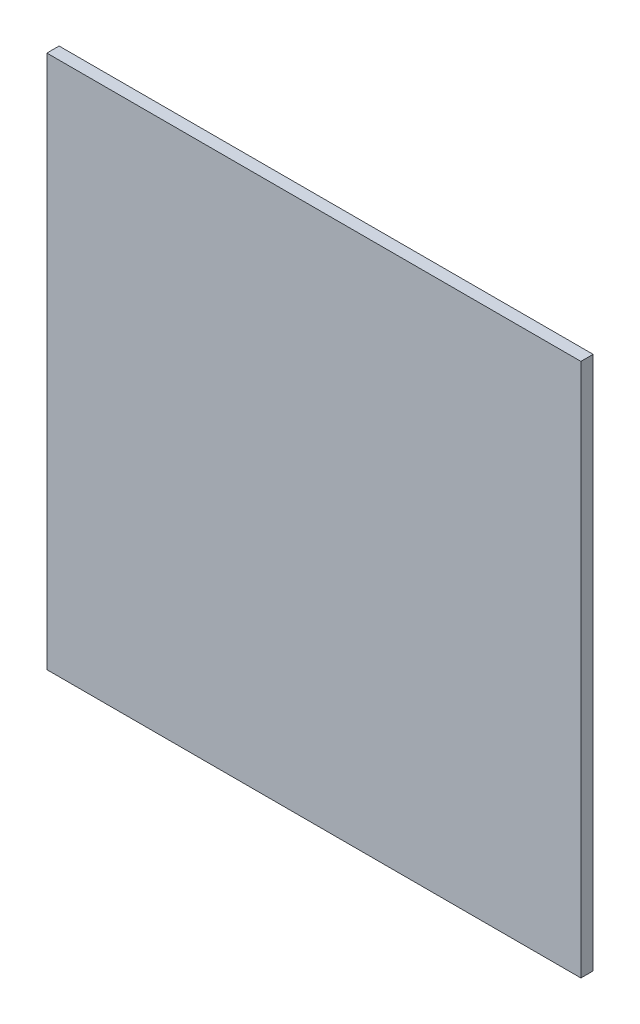
ISO-10303-21;
HEADER;
FILE_DESCRIPTION(('STEP AP214'),'2;1');
FILE_NAME('part.step','',(''),(''),'','','');
FILE_SCHEMA(('AUTOMOTIVE_DESIGN { 1 0 10303 214 1 1 1 1 }'));
ENDSEC;
DATA;
#1=APPLICATION_CONTEXT('core data for automotive mechanical design processes');
#2=APPLICATION_PROTOCOL_DEFINITION('international standard','automotive_design',2000,#1);
#3=PRODUCT_CONTEXT('',#1,'mechanical');
#4=PRODUCT('Part','Part','',(#3));
#5=PRODUCT_RELATED_PRODUCT_CATEGORY('part','',(#4));
#6=PRODUCT_DEFINITION_FORMATION('','',#4);
#7=PRODUCT_DEFINITION_CONTEXT('part definition',#1,'design');
#8=PRODUCT_DEFINITION('design','',#6,#7);
#9=PRODUCT_DEFINITION_SHAPE('','',#8);
#10=(LENGTH_UNIT() NAMED_UNIT(*) SI_UNIT(.MILLI.,.METRE.));
#11=(NAMED_UNIT(*) PLANE_ANGLE_UNIT() SI_UNIT($,.RADIAN.));
#12=(NAMED_UNIT(*) SI_UNIT($,.STERADIAN.) SOLID_ANGLE_UNIT());
#13=UNCERTAINTY_MEASURE_WITH_UNIT(LENGTH_MEASURE(1.E-05),#10,'distance_accuracy_value','');
#14=(GEOMETRIC_REPRESENTATION_CONTEXT(3) GLOBAL_UNCERTAINTY_ASSIGNED_CONTEXT((#13)) GLOBAL_UNIT_ASSIGNED_CONTEXT((#10,
#11,#12)) REPRESENTATION_CONTEXT('',''));
#15=CARTESIAN_POINT('',(0.,0.,0.));
#16=DIRECTION('',(0.,0.,1.));
#17=DIRECTION('',(1.,0.,0.));
#18=AXIS2_PLACEMENT_3D('',#15,#16,#17);
#19=CARTESIAN_POINT('',(0.,0.,0.));
#20=DIRECTION('',(1.,0.,0.));
#21=DIRECTION('',(0.,0.,1.));
#22=AXIS2_PLACEMENT_3D('',#19,#20,#21);
#23=PLANE('',#22);
#24=DIRECTION('',(0.,1.,0.));
#25=VECTOR('',#24,1.);
#26=CARTESIAN_POINT('',(0.,0.,0.1));
#27=LINE('',#26,#25);
#28=CARTESIAN_POINT('',(0.,0.,0.1));
#29=VERTEX_POINT('',#28);
#30=CARTESIAN_POINT('',(0.,4.37,0.1));
#31=VERTEX_POINT('',#30);
#32=EDGE_CURVE('E11',#29,#31,#27,.T.);
#33=ORIENTED_EDGE('',*,*,#32,.T.);
#34=DIRECTION('',(0.,0.,1.));
#35=VECTOR('',#34,1.);
#36=CARTESIAN_POINT('',(0.,4.37,0.));
#37=LINE('',#36,#35);
#38=CARTESIAN_POINT('',(0.,4.37,0.));
#39=VERTEX_POINT('',#38);
#40=EDGE_CURVE('E24',#39,#31,#37,.T.);
#41=ORIENTED_EDGE('',*,*,#40,.F.);
#42=DIRECTION('',(0.,1.,0.));
#43=VECTOR('',#42,1.);
#44=CARTESIAN_POINT('',(0.,0.,0.));
#45=LINE('',#44,#43);
#46=CARTESIAN_POINT('',(0.,0.,0.));
#47=VERTEX_POINT('',#46);
#48=EDGE_CURVE('E86',#47,#39,#45,.T.);
#49=ORIENTED_EDGE('',*,*,#48,.F.);
#50=DIRECTION('',(0.,0.,1.));
#51=VECTOR('',#50,1.);
#52=CARTESIAN_POINT('',(0.,0.,0.));
#53=LINE('',#52,#51);
#54=EDGE_CURVE('E36',#47,#29,#53,.T.);
#55=ORIENTED_EDGE('',*,*,#54,.T.);
#56=EDGE_LOOP('',(#33,#41,#49,#55));
#57=FACE_BOUND('',#56,.T.);
#58=ADVANCED_FACE('F17',(#57),#23,.F.);
#59=CARTESIAN_POINT('',(4.37,0.,0.));
#60=DIRECTION('',(1.,0.,0.));
#61=DIRECTION('',(0.,0.,1.));
#62=AXIS2_PLACEMENT_3D('',#59,#60,#61);
#63=PLANE('',#62);
#64=DIRECTION('',(0.,0.,1.));
#65=VECTOR('',#64,1.);
#66=CARTESIAN_POINT('',(4.37,0.,0.));
#67=LINE('',#66,#65);
#68=CARTESIAN_POINT('',(4.37,0.,0.));
#69=VERTEX_POINT('',#68);
#70=CARTESIAN_POINT('',(4.37,0.,0.1));
#71=VERTEX_POINT('',#70);
#72=EDGE_CURVE('E83',#69,#71,#67,.T.);
#73=ORIENTED_EDGE('',*,*,#72,.F.);
#74=DIRECTION('',(0.,1.,0.));
#75=VECTOR('',#74,1.);
#76=CARTESIAN_POINT('',(4.37,0.,0.));
#77=LINE('',#76,#75);
#78=CARTESIAN_POINT('',(4.37,4.37,0.));
#79=VERTEX_POINT('',#78);
#80=EDGE_CURVE('E63',#69,#79,#77,.T.);
#81=ORIENTED_EDGE('',*,*,#80,.T.);
#82=DIRECTION('',(0.,0.,1.));
#83=VECTOR('',#82,1.);
#84=CARTESIAN_POINT('',(4.37,4.37,0.));
#85=LINE('',#84,#83);
#86=CARTESIAN_POINT('',(4.37,4.37,0.1));
#87=VERTEX_POINT('',#86);
#88=EDGE_CURVE('E57',#79,#87,#85,.T.);
#89=ORIENTED_EDGE('',*,*,#88,.T.);
#90=DIRECTION('',(0.,1.,0.));
#91=VECTOR('',#90,1.);
#92=CARTESIAN_POINT('',(4.37,0.,0.1));
#93=LINE('',#92,#91);
#94=EDGE_CURVE('E60',#71,#87,#93,.T.);
#95=ORIENTED_EDGE('',*,*,#94,.F.);
#96=EDGE_LOOP('',(#73,#81,#89,#95));
#97=FACE_BOUND('',#96,.T.);
#98=ADVANCED_FACE('F59',(#97),#63,.T.);
#99=CARTESIAN_POINT('',(0.,0.,0.));
#100=DIRECTION('',(0.,1.,0.));
#101=DIRECTION('',(0.,0.,1.));
#102=AXIS2_PLACEMENT_3D('',#99,#100,#101);
#103=PLANE('',#102);
#104=ORIENTED_EDGE('',*,*,#72,.T.);
#105=DIRECTION('',(1.,0.,0.));
#106=VECTOR('',#105,1.);
#107=CARTESIAN_POINT('',(0.,0.,0.1));
#108=LINE('',#107,#106);
#109=EDGE_CURVE('E71',#29,#71,#108,.T.);
#110=ORIENTED_EDGE('',*,*,#109,.F.);
#111=ORIENTED_EDGE('',*,*,#54,.F.);
#112=DIRECTION('',(1.,0.,0.));
#113=VECTOR('',#112,1.);
#114=CARTESIAN_POINT('',(0.,0.,0.));
#115=LINE('',#114,#113);
#116=EDGE_CURVE('E76',#47,#69,#115,.T.);
#117=ORIENTED_EDGE('',*,*,#116,.T.);
#118=EDGE_LOOP('',(#104,#110,#111,#117));
#119=FACE_BOUND('',#118,.T.);
#120=ADVANCED_FACE('F91',(#119),#103,.F.);
#121=CARTESIAN_POINT('',(0.,4.37,0.));
#122=DIRECTION('',(0.,1.,0.));
#123=DIRECTION('',(0.,0.,1.));
#124=AXIS2_PLACEMENT_3D('',#121,#122,#123);
#125=PLANE('',#124);
#126=DIRECTION('',(1.,0.,0.));
#127=VECTOR('',#126,1.);
#128=CARTESIAN_POINT('',(0.,4.37,0.));
#129=LINE('',#128,#127);
#130=EDGE_CURVE('E74',#39,#79,#129,.T.);
#131=ORIENTED_EDGE('',*,*,#130,.F.);
#132=ORIENTED_EDGE('',*,*,#40,.T.);
#133=DIRECTION('',(1.,0.,0.));
#134=VECTOR('',#133,1.);
#135=CARTESIAN_POINT('',(0.,4.37,0.1));
#136=LINE('',#135,#134);
#137=EDGE_CURVE('E69',#31,#87,#136,.T.);
#138=ORIENTED_EDGE('',*,*,#137,.T.);
#139=ORIENTED_EDGE('',*,*,#88,.F.);
#140=EDGE_LOOP('',(#131,#132,#138,#139));
#141=FACE_BOUND('',#140,.T.);
#142=ADVANCED_FACE('F73',(#141),#125,.T.);
#143=CARTESIAN_POINT('',(0.,0.,0.));
#144=DIRECTION('',(0.,0.,1.));
#145=DIRECTION('',(1.,0.,0.));
#146=AXIS2_PLACEMENT_3D('',#143,#144,#145);
#147=PLANE('',#146);
#148=ORIENTED_EDGE('',*,*,#130,.T.);
#149=ORIENTED_EDGE('',*,*,#80,.F.);
#150=ORIENTED_EDGE('',*,*,#116,.F.);
#151=ORIENTED_EDGE('',*,*,#48,.T.);
#152=EDGE_LOOP('',(#148,#149,#150,#151));
#153=FACE_BOUND('',#152,.T.);
#154=ADVANCED_FACE('F89',(#153),#147,.F.);
#155=CARTESIAN_POINT('',(0.,0.,0.1));
#156=DIRECTION('',(0.,0.,1.));
#157=DIRECTION('',(1.,0.,0.));
#158=AXIS2_PLACEMENT_3D('',#155,#156,#157);
#159=PLANE('',#158);
#160=ORIENTED_EDGE('',*,*,#32,.F.);
#161=ORIENTED_EDGE('',*,*,#109,.T.);
#162=ORIENTED_EDGE('',*,*,#94,.T.);
#163=ORIENTED_EDGE('',*,*,#137,.F.);
#164=EDGE_LOOP('',(#160,#161,#162,#163));
#165=FACE_BOUND('',#164,.T.);
#166=ADVANCED_FACE('F68',(#165),#159,.T.);
#167=CLOSED_SHELL('',(#58,#98,#120,#142,#154,#166));
#168=MANIFOLD_SOLID_BREP('B1',#167);
#169=ADVANCED_BREP_SHAPE_REPRESENTATION('',(#18,#168),#14);
#170=SHAPE_DEFINITION_REPRESENTATION(#9,#169);
ENDSEC;
END-ISO-10303-21;
